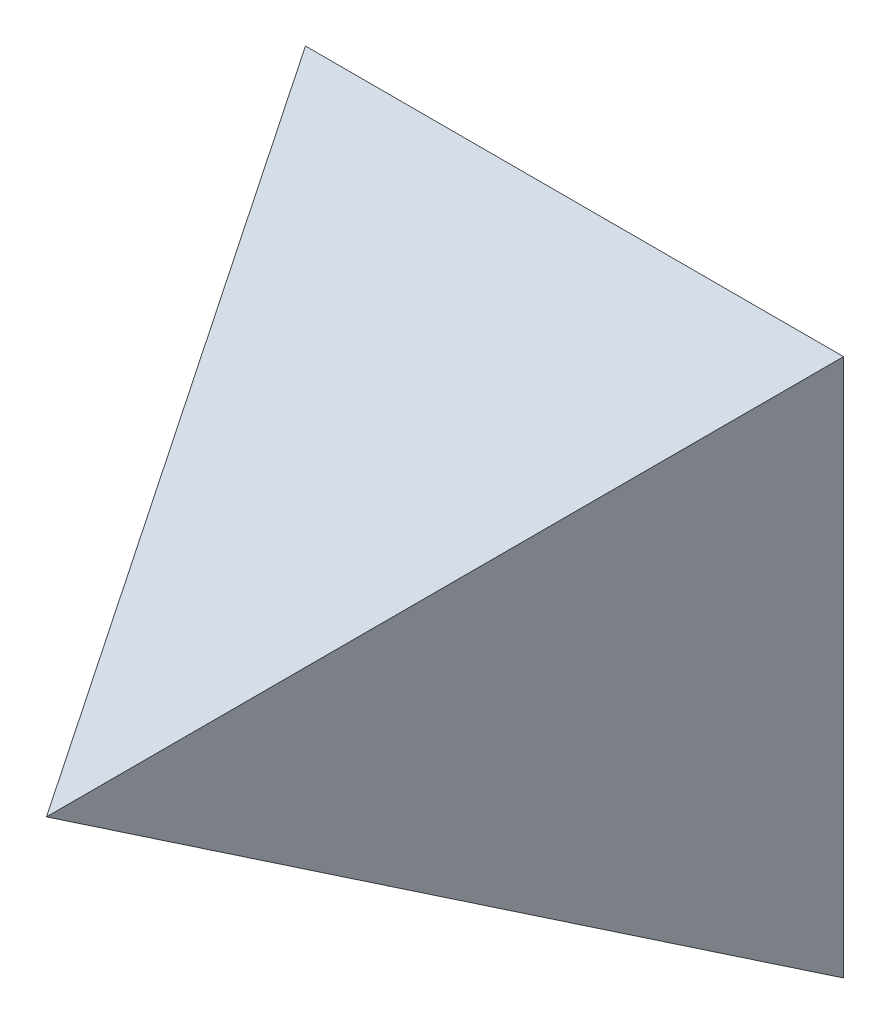
ISO-10303-21;
HEADER;
FILE_DESCRIPTION(('STEP AP214'),'2;1');
FILE_NAME('part.step','',(''),(''),'','','');
FILE_SCHEMA(('AUTOMOTIVE_DESIGN { 1 0 10303 214 1 1 1 1 }'));
ENDSEC;
DATA;
#1=APPLICATION_CONTEXT('core data for automotive mechanical design processes');
#2=APPLICATION_PROTOCOL_DEFINITION('international standard','automotive_design',2000,#1);
#3=PRODUCT_CONTEXT('',#1,'mechanical');
#4=PRODUCT('Part','Part','',(#3));
#5=PRODUCT_RELATED_PRODUCT_CATEGORY('part','',(#4));
#6=PRODUCT_DEFINITION_FORMATION('','',#4);
#7=PRODUCT_DEFINITION_CONTEXT('part definition',#1,'design');
#8=PRODUCT_DEFINITION('design','',#6,#7);
#9=PRODUCT_DEFINITION_SHAPE('','',#8);
#10=(LENGTH_UNIT() NAMED_UNIT(*) SI_UNIT(.MILLI.,.METRE.));
#11=(NAMED_UNIT(*) PLANE_ANGLE_UNIT() SI_UNIT($,.RADIAN.));
#12=(NAMED_UNIT(*) SI_UNIT($,.STERADIAN.) SOLID_ANGLE_UNIT());
#13=UNCERTAINTY_MEASURE_WITH_UNIT(LENGTH_MEASURE(1.E-05),#10,'distance_accuracy_value','');
#14=(GEOMETRIC_REPRESENTATION_CONTEXT(3) GLOBAL_UNCERTAINTY_ASSIGNED_CONTEXT((#13)) GLOBAL_UNIT_ASSIGNED_CONTEXT((#10,
#11,#12)) REPRESENTATION_CONTEXT('',''));
#15=CARTESIAN_POINT('',(0.,0.,0.));
#16=DIRECTION('',(0.,0.,1.));
#17=DIRECTION('',(1.,0.,0.));
#18=AXIS2_PLACEMENT_3D('',#15,#16,#17);
#19=CARTESIAN_POINT('',(-16.4331210191083,10.,0.));
#20=DIRECTION('',(-0.891006524188368,0.,0.453990499739547));
#21=DIRECTION('',(0.453990499739547,0.,0.891006524188368));
#22=AXIS2_PLACEMENT_3D('',#19,#20,#21);
#23=PLANE('',#22);
#24=DIRECTION('',(0.,-1.,0.));
#25=VECTOR('',#24,1.);
#26=CARTESIAN_POINT('',(-16.4331210191083,10.,0.));
#27=LINE('',#26,#25);
#28=CARTESIAN_POINT('',(-16.4331210191083,10.,0.));
#29=VERTEX_POINT('',#28);
#30=CARTESIAN_POINT('',(-16.4331210191083,0.,0.));
#31=VERTEX_POINT('',#30);
#32=EDGE_CURVE('E70',#29,#31,#27,.T.);
#33=ORIENTED_EDGE('',*,*,#32,.T.);
#34=DIRECTION('',(-0.413384109704204,-0.413384109704204,-0.811311996514365));
#35=VECTOR('',#34,1.);
#36=CARTESIAN_POINT('',(-16.4331210191083,0.,0.));
#37=LINE('',#36,#35);
#38=CARTESIAN_POINT('',(-11.4331210191083,5.,9.81305252752574));
#39=VERTEX_POINT('',#38);
#40=EDGE_CURVE('E11',#39,#31,#37,.T.);
#41=ORIENTED_EDGE('',*,*,#40,.F.);
#42=DIRECTION('',(-0.413384109704204,0.413384109704204,-0.811311996514365));
#43=VECTOR('',#42,1.);
#44=CARTESIAN_POINT('',(-16.4331210191083,10.,0.));
#45=LINE('',#44,#43);
#46=EDGE_CURVE('E55',#39,#29,#45,.T.);
#47=ORIENTED_EDGE('',*,*,#46,.T.);
#48=EDGE_LOOP('',(#33,#41,#47));
#49=FACE_BOUND('',#48,.T.);
#50=ADVANCED_FACE('F33',(#49),#23,.T.);
#51=CARTESIAN_POINT('',(-16.4331210191083,0.,0.));
#52=DIRECTION('',(0.,-0.891006524188368,0.453990499739547));
#53=DIRECTION('',(0.,-0.453990499739547,-0.891006524188368));
#54=AXIS2_PLACEMENT_3D('',#51,#52,#53);
#55=PLANE('',#54);
#56=DIRECTION('',(1.,0.,0.));
#57=VECTOR('',#56,1.);
#58=CARTESIAN_POINT('',(-16.4331210191083,0.,0.));
#59=LINE('',#58,#57);
#60=CARTESIAN_POINT('',(-6.43312101910828,0.,0.));
#61=VERTEX_POINT('',#60);
#62=EDGE_CURVE('E67',#31,#61,#59,.T.);
#63=ORIENTED_EDGE('',*,*,#62,.T.);
#64=DIRECTION('',(0.413384109704205,-0.413384109704204,-0.811311996514365));
#65=VECTOR('',#64,1.);
#66=CARTESIAN_POINT('',(-8.14198524066766,1.70886422155938,3.35383487371431));
#67=LINE('',#66,#65);
#68=EDGE_CURVE('E37',#39,#61,#67,.T.);
#69=ORIENTED_EDGE('',*,*,#68,.F.);
#70=ORIENTED_EDGE('',*,*,#40,.T.);
#71=EDGE_LOOP('',(#63,#69,#70));
#72=FACE_BOUND('',#71,.T.);
#73=ADVANCED_FACE('F35',(#72),#55,.T.);
#74=CARTESIAN_POINT('',(-6.43312101910828,10.,0.));
#75=DIRECTION('',(0.891006524188368,0.,0.453990499739547));
#76=DIRECTION('',(0.453990499739547,0.,-0.891006524188368));
#77=AXIS2_PLACEMENT_3D('',#74,#75,#76);
#78=PLANE('',#77);
#79=DIRECTION('',(0.,1.,0.));
#80=VECTOR('',#79,1.);
#81=CARTESIAN_POINT('',(-6.43312101910828,10.,0.));
#82=LINE('',#81,#80);
#83=CARTESIAN_POINT('',(-6.43312101910828,10.,0.));
#84=VERTEX_POINT('',#83);
#85=EDGE_CURVE('E72',#61,#84,#82,.T.);
#86=ORIENTED_EDGE('',*,*,#85,.T.);
#87=DIRECTION('',(0.413384109704204,0.413384109704204,-0.811311996514365));
#88=VECTOR('',#87,1.);
#89=CARTESIAN_POINT('',(-8.14198524066766,8.29113577844062,3.35383487371431));
#90=LINE('',#89,#88);
#91=EDGE_CURVE('E79',#39,#84,#90,.T.);
#92=ORIENTED_EDGE('',*,*,#91,.F.);
#93=ORIENTED_EDGE('',*,*,#68,.T.);
#94=EDGE_LOOP('',(#86,#92,#93));
#95=FACE_BOUND('',#94,.T.);
#96=ADVANCED_FACE('F82',(#95),#78,.T.);
#97=CARTESIAN_POINT('',(-16.4331210191083,10.,0.));
#98=DIRECTION('',(0.,0.891006524188368,0.453990499739547));
#99=DIRECTION('',(0.,-0.453990499739547,0.891006524188368));
#100=AXIS2_PLACEMENT_3D('',#97,#98,#99);
#101=PLANE('',#100);
#102=DIRECTION('',(-1.,0.,0.));
#103=VECTOR('',#102,1.);
#104=CARTESIAN_POINT('',(-16.4331210191083,10.,0.));
#105=LINE('',#104,#103);
#106=EDGE_CURVE('E77',#84,#29,#105,.T.);
#107=ORIENTED_EDGE('',*,*,#106,.T.);
#108=ORIENTED_EDGE('',*,*,#46,.F.);
#109=ORIENTED_EDGE('',*,*,#91,.T.);
#110=EDGE_LOOP('',(#107,#108,#109));
#111=FACE_BOUND('',#110,.T.);
#112=ADVANCED_FACE('F83',(#111),#101,.T.);
#113=CARTESIAN_POINT('',(0.,0.,0.));
#114=DIRECTION('',(0.,0.,1.));
#115=DIRECTION('',(1.,0.,0.));
#116=AXIS2_PLACEMENT_3D('',#113,#114,#115);
#117=PLANE('',#116);
#118=ORIENTED_EDGE('',*,*,#32,.F.);
#119=ORIENTED_EDGE('',*,*,#106,.F.);
#120=ORIENTED_EDGE('',*,*,#85,.F.);
#121=ORIENTED_EDGE('',*,*,#62,.F.);
#122=EDGE_LOOP('',(#118,#119,#120,#121));
#123=FACE_BOUND('',#122,.T.);
#124=ADVANCED_FACE('F68',(#123),#117,.F.);
#125=CLOSED_SHELL('',(#50,#73,#96,#112,#124));
#126=MANIFOLD_SOLID_BREP('B2',#125);
#127=ADVANCED_BREP_SHAPE_REPRESENTATION('',(#18,#126),#14);
#128=SHAPE_DEFINITION_REPRESENTATION(#9,#127);
ENDSEC;
END-ISO-10303-21;
